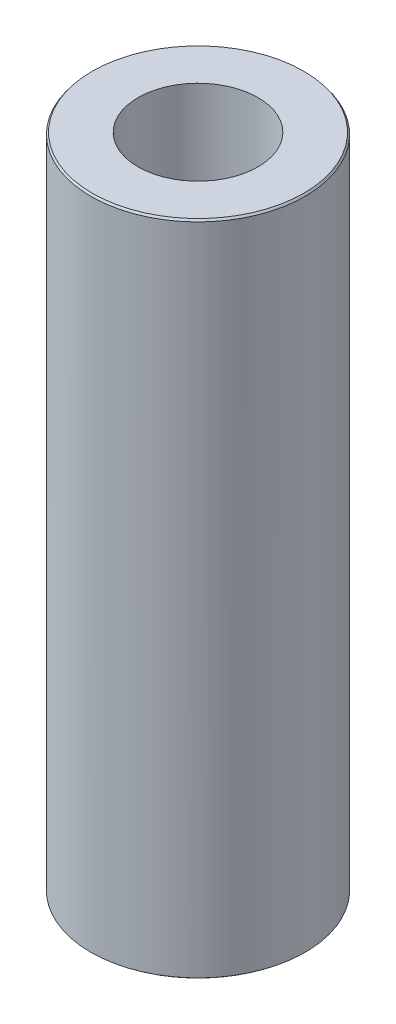
ISO-10303-21;
HEADER;
FILE_DESCRIPTION(('STEP AP214'),'2;1');
FILE_NAME('part.step','',(''),(''),'','','');
FILE_SCHEMA(('AUTOMOTIVE_DESIGN { 1 0 10303 214 1 1 1 1 }'));
ENDSEC;
DATA;
#1=APPLICATION_CONTEXT('core data for automotive mechanical design processes');
#2=APPLICATION_PROTOCOL_DEFINITION('international standard','automotive_design',2000,#1);
#3=PRODUCT_CONTEXT('',#1,'mechanical');
#4=PRODUCT('Part','Part','',(#3));
#5=PRODUCT_RELATED_PRODUCT_CATEGORY('part','',(#4));
#6=PRODUCT_DEFINITION_FORMATION('','',#4);
#7=PRODUCT_DEFINITION_CONTEXT('part definition',#1,'design');
#8=PRODUCT_DEFINITION('design','',#6,#7);
#9=PRODUCT_DEFINITION_SHAPE('','',#8);
#10=(LENGTH_UNIT() NAMED_UNIT(*) SI_UNIT(.MILLI.,.METRE.));
#11=(NAMED_UNIT(*) PLANE_ANGLE_UNIT() SI_UNIT($,.RADIAN.));
#12=(NAMED_UNIT(*) SI_UNIT($,.STERADIAN.) SOLID_ANGLE_UNIT());
#13=UNCERTAINTY_MEASURE_WITH_UNIT(LENGTH_MEASURE(1.E-05),#10,'distance_accuracy_value','');
#14=(GEOMETRIC_REPRESENTATION_CONTEXT(3) GLOBAL_UNCERTAINTY_ASSIGNED_CONTEXT((#13)) GLOBAL_UNIT_ASSIGNED_CONTEXT((#10,
#11,#12)) REPRESENTATION_CONTEXT('',''));
#15=CARTESIAN_POINT('',(0.,0.,0.));
#16=DIRECTION('',(0.,0.,1.));
#17=DIRECTION('',(1.,0.,0.));
#18=AXIS2_PLACEMENT_3D('',#15,#16,#17);
#19=CARTESIAN_POINT('',(0.,291.53043642556,0.));
#20=DIRECTION('',(0.,-1.,0.));
#21=DIRECTION('',(0.,0.,-1.));
#22=AXIS2_PLACEMENT_3D('',#19,#20,#21);
#23=CYLINDRICAL_SURFACE('',#22,47.5);
#24=CARTESIAN_POINT('',(0.,290.691529809993,0.));
#25=DIRECTION('',(0.,1.,0.));
#26=DIRECTION('',(0.,0.,1.));
#27=AXIS2_PLACEMENT_3D('',#24,#25,#26);
#28=CIRCLE('',#27,47.5);
#29=CARTESIAN_POINT('',(0.,290.691529809993,-47.5));
#30=VERTEX_POINT('',#29);
#31=EDGE_CURVE('E50',#30,#30,#28,.F.);
#32=ORIENTED_EDGE('',*,*,#31,.T.);
#33=EDGE_LOOP('',(#32));
#34=FACE_BOUND('',#33,.T.);
#35=CARTESIAN_POINT('',(0.,0.656438447974306,0.));
#36=DIRECTION('',(0.,1.,0.));
#37=DIRECTION('',(0.,0.,1.));
#38=AXIS2_PLACEMENT_3D('',#35,#36,#37);
#39=CIRCLE('',#38,47.5);
#40=CARTESIAN_POINT('',(0.,0.656438447974306,47.5));
#41=VERTEX_POINT('',#40);
#42=EDGE_CURVE('E51',#41,#41,#39,.T.);
#43=ORIENTED_EDGE('',*,*,#42,.T.);
#44=EDGE_LOOP('',(#43));
#45=FACE_BOUND('',#44,.T.);
#46=ADVANCED_FACE('F39',(#34,#45),#23,.T.);
#47=CARTESIAN_POINT('',(0.,291.53043642556,0.));
#48=DIRECTION('',(0.,1.,0.));
#49=DIRECTION('',(0.,0.,1.));
#50=AXIS2_PLACEMENT_3D('',#47,#48,#49);
#51=PLANE('',#50);
#52=CARTESIAN_POINT('',(0.,291.53043642556,0.));
#53=DIRECTION('',(0.,1.,0.));
#54=DIRECTION('',(0.,0.,1.));
#55=AXIS2_PLACEMENT_3D('',#52,#53,#54);
#56=CIRCLE('',#55,46.8435615520256);
#57=CARTESIAN_POINT('',(0.,291.53043642556,-46.8435615520257));
#58=VERTEX_POINT('',#57);
#59=EDGE_CURVE('E54',#58,#58,#56,.T.);
#60=ORIENTED_EDGE('',*,*,#59,.T.);
#61=EDGE_LOOP('',(#60));
#62=FACE_BOUND('',#61,.T.);
#63=CARTESIAN_POINT('',(0.,291.53043642556,0.));
#64=DIRECTION('',(0.,1.,0.));
#65=DIRECTION('',(0.,0.,1.));
#66=AXIS2_PLACEMENT_3D('',#63,#64,#65);
#67=CIRCLE('',#66,26.588189359329);
#68=CARTESIAN_POINT('',(0.,291.53043642556,26.588189359329));
#69=VERTEX_POINT('',#68);
#70=EDGE_CURVE('E58',#69,#69,#67,.T.);
#71=ORIENTED_EDGE('',*,*,#70,.F.);
#72=EDGE_LOOP('',(#71));
#73=FACE_BOUND('',#72,.T.);
#74=ADVANCED_FACE('F69',(#62,#73),#51,.T.);
#75=CARTESIAN_POINT('',(0.,0.,0.));
#76=DIRECTION('',(0.,1.,0.));
#77=DIRECTION('',(0.,0.,1.));
#78=AXIS2_PLACEMENT_3D('',#75,#76,#77);
#79=PLANE('',#78);
#80=CARTESIAN_POINT('',(0.,0.,0.));
#81=DIRECTION('',(0.,1.,0.));
#82=DIRECTION('',(0.,0.,1.));
#83=AXIS2_PLACEMENT_3D('',#80,#81,#82);
#84=CIRCLE('',#83,46.6610933844333);
#85=CARTESIAN_POINT('',(0.,0.,46.6610933844333));
#86=VERTEX_POINT('',#85);
#87=EDGE_CURVE('E10',#86,#86,#84,.F.);
#88=ORIENTED_EDGE('',*,*,#87,.T.);
#89=EDGE_LOOP('',(#88));
#90=FACE_BOUND('',#89,.T.);
#91=CARTESIAN_POINT('',(0.,0.,0.));
#92=DIRECTION('',(0.,1.,0.));
#93=DIRECTION('',(0.,0.,1.));
#94=AXIS2_PLACEMENT_3D('',#91,#92,#93);
#95=CIRCLE('',#94,26.588189359329);
#96=CARTESIAN_POINT('',(0.,0.,26.588189359329));
#97=VERTEX_POINT('',#96);
#98=EDGE_CURVE('E63',#97,#97,#95,.T.);
#99=ORIENTED_EDGE('',*,*,#98,.T.);
#100=EDGE_LOOP('',(#99));
#101=FACE_BOUND('',#100,.T.);
#102=ADVANCED_FACE('F75',(#90,#101),#79,.F.);
#103=CARTESIAN_POINT('',(0.,291.53043642556,0.));
#104=DIRECTION('',(0.,-1.,0.));
#105=DIRECTION('',(0.,0.,-1.));
#106=AXIS2_PLACEMENT_3D('',#103,#104,#105);
#107=CYLINDRICAL_SURFACE('',#106,26.588189359329);
#108=ORIENTED_EDGE('',*,*,#70,.T.);
#109=EDGE_LOOP('',(#108));
#110=FACE_BOUND('',#109,.T.);
#111=ORIENTED_EDGE('',*,*,#98,.F.);
#112=EDGE_LOOP('',(#111));
#113=FACE_BOUND('',#112,.T.);
#114=ADVANCED_FACE('F70',(#110,#113),#107,.F.);
#115=CARTESIAN_POINT('',(0.,291.53043642556,0.));
#116=DIRECTION('',(0.,-1.,0.));
#117=DIRECTION('',(0.,0.,-1.));
#118=AXIS2_PLACEMENT_3D('',#115,#116,#117);
#119=CONICAL_SURFACE('',#118,46.8435615520256,0.663974329868489);
#120=CARTESIAN_POINT('',(0.,290.691529809993,-47.5));
#121=CARTESIAN_POINT('',(0.,290.700268420572,-47.4931620995003));
#122=CARTESIAN_POINT('',(0.,290.709007031151,-47.4863241990006));
#123=CARTESIAN_POINT('',(0.,290.726484252309,-47.4726483980011));
#124=CARTESIAN_POINT('',(0.,290.735222862887,-47.4658104975014));
#125=CARTESIAN_POINT('',(0.,290.752700084045,-47.4521346965019));
#126=CARTESIAN_POINT('',(0.,290.761438694624,-47.4452967960022));
#127=CARTESIAN_POINT('',(0.,290.778915915781,-47.4316209950027));
#128=CARTESIAN_POINT('',(0.,290.78765452636,-47.424783094503));
#129=CARTESIAN_POINT('',(0.,290.805131747518,-47.4111072935035));
#130=CARTESIAN_POINT('',(0.,290.813870358097,-47.4042693930038));
#131=CARTESIAN_POINT('',(0.,290.831347579254,-47.3905935920043));
#132=CARTESIAN_POINT('',(0.,290.840086189833,-47.3837556915046));
#133=CARTESIAN_POINT('',(0.,290.857563410991,-47.3700798905051));
#134=CARTESIAN_POINT('',(0.,290.86630202157,-47.3632419900054));
#135=CARTESIAN_POINT('',(0.,290.883779242727,-47.3495661890059));
#136=CARTESIAN_POINT('',(0.,290.892517853306,-47.3427282885062));
#137=CARTESIAN_POINT('',(0.,290.909995074464,-47.3290524875067));
#138=CARTESIAN_POINT('',(0.,290.918733685043,-47.322214587007));
#139=CARTESIAN_POINT('',(0.,290.9362109062,-47.3085387860075));
#140=CARTESIAN_POINT('',(0.,290.944949516779,-47.3017008855078));
#141=CARTESIAN_POINT('',(0.,290.962426737937,-47.2880250845083));
#142=CARTESIAN_POINT('',(0.,290.971165348516,-47.2811871840086));
#143=CARTESIAN_POINT('',(0.,290.988642569673,-47.2675113830091));
#144=CARTESIAN_POINT('',(0.,290.997381180252,-47.2606734825094));
#145=CARTESIAN_POINT('',(0.,291.01485840141,-47.2469976815099));
#146=CARTESIAN_POINT('',(0.,291.023597011988,-47.2401597810102));
#147=CARTESIAN_POINT('',(0.,291.041074233146,-47.2264839800107));
#148=CARTESIAN_POINT('',(0.,291.049812843725,-47.219646079511));
#149=CARTESIAN_POINT('',(0.,291.067290064883,-47.2059702785115));
#150=CARTESIAN_POINT('',(0.,291.076028675461,-47.1991323780118));
#151=CARTESIAN_POINT('',(0.,291.093505896619,-47.1854565770123));
#152=CARTESIAN_POINT('',(0.,291.102244507198,-47.1786186765126));
#153=CARTESIAN_POINT('',(0.,291.119721728355,-47.1649428755131));
#154=CARTESIAN_POINT('',(0.,291.128460338934,-47.1581049750134));
#155=CARTESIAN_POINT('',(0.,291.145937560092,-47.1444291740139));
#156=CARTESIAN_POINT('',(0.,291.154676170671,-47.1375912735142));
#157=CARTESIAN_POINT('',(0.,291.172153391828,-47.1239154725147));
#158=CARTESIAN_POINT('',(0.,291.180892002407,-47.117077572015));
#159=CARTESIAN_POINT('',(0.,291.198369223565,-47.1034017710155));
#160=CARTESIAN_POINT('',(0.,291.207107834144,-47.0965638705158));
#161=CARTESIAN_POINT('',(0.,291.224585055301,-47.0828880695163));
#162=CARTESIAN_POINT('',(0.,291.23332366588,-47.0760501690166));
#163=CARTESIAN_POINT('',(0.,291.250800887038,-47.0623743680171));
#164=CARTESIAN_POINT('',(0.,291.259539497617,-47.0555364675174));
#165=CARTESIAN_POINT('',(0.,291.277016718774,-47.0418606665179));
#166=CARTESIAN_POINT('',(0.,291.285755329353,-47.0350227660182));
#167=CARTESIAN_POINT('',(0.,291.303232550511,-47.0213469650187));
#168=CARTESIAN_POINT('',(0.,291.31197116109,-47.014509064519));
#169=CARTESIAN_POINT('',(0.,291.329448382247,-47.0008332635195));
#170=CARTESIAN_POINT('',(0.,291.338186992826,-46.9939953630198));
#171=CARTESIAN_POINT('',(0.,291.355664213984,-46.9803195620203));
#172=CARTESIAN_POINT('',(0.,291.364402824562,-46.9734816615206));
#173=CARTESIAN_POINT('',(0.,291.38188004572,-46.9598058605211));
#174=CARTESIAN_POINT('',(0.,291.390618656299,-46.9529679600214));
#175=CARTESIAN_POINT('',(0.,291.408095877457,-46.9392921590219));
#176=CARTESIAN_POINT('',(0.,291.416834488035,-46.9324542585222));
#177=CARTESIAN_POINT('',(0.,291.434311709193,-46.9187784575227));
#178=CARTESIAN_POINT('',(0.,291.443050319772,-46.911940557023));
#179=CARTESIAN_POINT('',(0.,291.460527540929,-46.8982647560235));
#180=CARTESIAN_POINT('',(0.,291.469266151508,-46.8914268555238));
#181=CARTESIAN_POINT('',(0.,291.486743372666,-46.8777510545243));
#182=CARTESIAN_POINT('',(0.,291.495481983245,-46.8709131540246));
#183=CARTESIAN_POINT('',(0.,291.512959204402,-46.8572373530251));
#184=CARTESIAN_POINT('',(0.,291.521697814981,-46.8503994525254));
#185=CARTESIAN_POINT('',(0.,291.53043642556,-46.8435615520257));
#186=B_SPLINE_CURVE_WITH_KNOTS('',3,(#120,#121,#122,#123,#124,#125,#126,#127,#128,#129,#130,
#131,#132,#133,#134,#135,#136,#137,#138,#139,#140,#141,#142,#143,#144,#145,#146,#147,#148,#149,
#150,#151,#152,#153,#154,#155,#156,#157,#158,#159,#160,#161,#162,#163,#164,#165,#166,#167,#168,
#169,#170,#171,#172,#173,#174,#175,#176,#177,#178,#179,#180,#181,#182,#183,#184,#185),
.UNSPECIFIED.,.F.,.F.,(4,2,2,2,2,2,2,2,2,2,2,2,2,2,2,2,2,2,2,2,2,2,2,2,2,2,2,2,2,2,2,2,4),(0.,
0.0332878623951011,0.0665757247901586,0.099863587185216,0.133151449580273,0.166439311975331,
0.199727174370432,0.233015036765489,0.266302899160547,0.299590761555604,0.332878623950662,
0.366166486345763,0.39945434874082,0.432742211135878,0.466030073530935,0.499317935925992,
0.53260579832105,0.565893660716151,0.599181523111208,0.632469385506266,0.665757247901323,
0.699045110296381,0.732332972691482,0.765620835086539,0.798908697481596,0.832196559876654,
0.865484422271711,0.898772284666812,0.93206014706187,0.965348009456927,0.998635871851984,
1.03192373424704,1.06521159664214),.UNSPECIFIED.);
#187=EDGE_CURVE('BSEAM81',#30,#58,#186,.T.);
#188=ORIENTED_EDGE('',*,*,#31,.F.);
#189=ORIENTED_EDGE('',*,*,#59,.F.);
#190=ORIENTED_EDGE('',*,*,#187,.T.);
#191=ORIENTED_EDGE('',*,*,#187,.F.);
#192=EDGE_LOOP('',(#188,#190,#189,#191));
#193=FACE_BOUND('',#192,.T.);
#194=ADVANCED_FACE('F81',(#193),#119,.T.);
#195=CARTESIAN_POINT('',(0.,0.656438447974306,0.));
#196=DIRECTION('',(0.,1.,0.));
#197=DIRECTION('',(0.,0.,1.));
#198=AXIS2_PLACEMENT_3D('',#195,#196,#197);
#199=CONICAL_SURFACE('',#198,47.5,0.906821996926397);
#200=ORIENTED_EDGE('',*,*,#87,.F.);
#201=EDGE_LOOP('',(#200));
#202=FACE_BOUND('',#201,.T.);
#203=ORIENTED_EDGE('',*,*,#42,.F.);
#204=EDGE_LOOP('',(#203));
#205=FACE_BOUND('',#204,.T.);
#206=ADVANCED_FACE('F45',(#202,#205),#199,.T.);
#207=CLOSED_SHELL('',(#46,#74,#102,#114,#194,#206));
#208=MANIFOLD_SOLID_BREP('B2',#207);
#209=ADVANCED_BREP_SHAPE_REPRESENTATION('',(#18,#208),#14);
#210=SHAPE_DEFINITION_REPRESENTATION(#9,#209);
ENDSEC;
END-ISO-10303-21;
